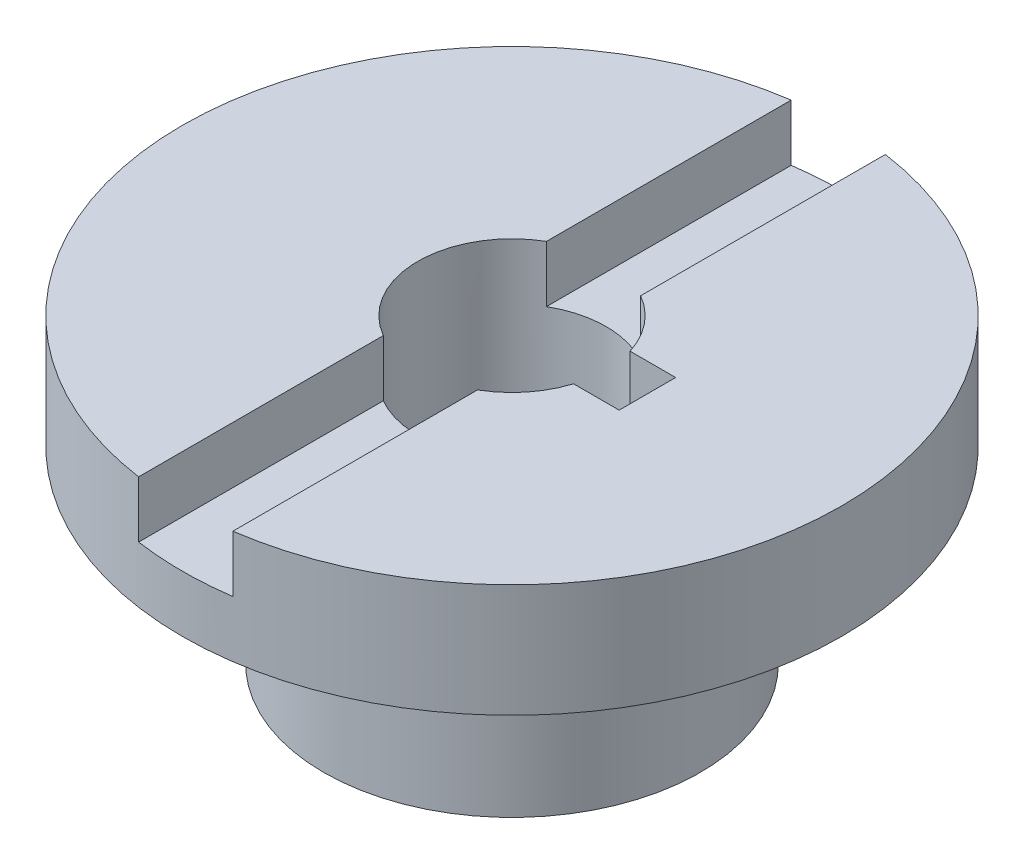
ISO-10303-21;
HEADER;
FILE_DESCRIPTION(('STEP AP214'),'2;1');
FILE_NAME('part.step','',(''),(''),'','','');
FILE_SCHEMA(('AUTOMOTIVE_DESIGN { 1 0 10303 214 1 1 1 1 }'));
ENDSEC;
DATA;
#1=APPLICATION_CONTEXT('core data for automotive mechanical design processes');
#2=APPLICATION_PROTOCOL_DEFINITION('international standard','automotive_design',2000,#1);
#3=PRODUCT_CONTEXT('',#1,'mechanical');
#4=PRODUCT('Part','Part','',(#3));
#5=PRODUCT_RELATED_PRODUCT_CATEGORY('part','',(#4));
#6=PRODUCT_DEFINITION_FORMATION('','',#4);
#7=PRODUCT_DEFINITION_CONTEXT('part definition',#1,'design');
#8=PRODUCT_DEFINITION('design','',#6,#7);
#9=PRODUCT_DEFINITION_SHAPE('','',#8);
#10=(LENGTH_UNIT() NAMED_UNIT(*) SI_UNIT(.MILLI.,.METRE.));
#11=(NAMED_UNIT(*) PLANE_ANGLE_UNIT() SI_UNIT($,.RADIAN.));
#12=(NAMED_UNIT(*) SI_UNIT($,.STERADIAN.) SOLID_ANGLE_UNIT());
#13=UNCERTAINTY_MEASURE_WITH_UNIT(LENGTH_MEASURE(1.E-05),#10,'distance_accuracy_value','');
#14=(GEOMETRIC_REPRESENTATION_CONTEXT(3) GLOBAL_UNCERTAINTY_ASSIGNED_CONTEXT((#13)) GLOBAL_UNIT_ASSIGNED_CONTEXT((#10,
#11,#12)) REPRESENTATION_CONTEXT('',''));
#15=CARTESIAN_POINT('',(0.,0.,0.));
#16=DIRECTION('',(0.,0.,1.));
#17=DIRECTION('',(1.,0.,0.));
#18=AXIS2_PLACEMENT_3D('',#15,#16,#17);
#19=CARTESIAN_POINT('',(-2.49999999999999,13.,27.));
#20=DIRECTION('',(0.,1.,0.));
#21=DIRECTION('',(0.,0.,1.));
#22=AXIS2_PLACEMENT_3D('',#19,#20,#21);
#23=PLANE('',#22);
#24=CARTESIAN_POINT('',(0.,13.,0.));
#25=DIRECTION('',(0.,1.,0.));
#26=DIRECTION('',(0.,0.,1.));
#27=AXIS2_PLACEMENT_3D('',#24,#25,#26);
#28=CIRCLE('',#27,5.);
#29=CARTESIAN_POINT('',(2.50000000000001,13.,-4.33012701892219));
#30=VERTEX_POINT('',#29);
#31=CARTESIAN_POINT('',(-2.49999999999999,13.,-4.3301270189222));
#32=VERTEX_POINT('',#31);
#33=EDGE_CURVE('E174',#30,#32,#28,.T.);
#34=ORIENTED_EDGE('',*,*,#33,.F.);
#35=DIRECTION('',(0.,0.,-1.));
#36=VECTOR('',#35,1.);
#37=CARTESIAN_POINT('',(2.50000000000001,13.,27.));
#38=LINE('',#37,#36);
#39=CARTESIAN_POINT('',(2.50000000000001,13.,-17.3205080756888));
#40=VERTEX_POINT('',#39);
#41=EDGE_CURVE('E188',#30,#40,#38,.T.);
#42=ORIENTED_EDGE('',*,*,#41,.T.);
#43=CARTESIAN_POINT('',(0.,13.,0.));
#44=DIRECTION('',(0.,1.,0.));
#45=DIRECTION('',(0.,0.,1.));
#46=AXIS2_PLACEMENT_3D('',#43,#44,#45);
#47=CIRCLE('',#46,17.5);
#48=CARTESIAN_POINT('',(-2.49999999999999,13.,-17.3205080756888));
#49=VERTEX_POINT('',#48);
#50=EDGE_CURVE('E245',#40,#49,#47,.T.);
#51=ORIENTED_EDGE('',*,*,#50,.T.);
#52=DIRECTION('',(0.,0.,-1.));
#53=VECTOR('',#52,1.);
#54=CARTESIAN_POINT('',(-2.49999999999999,13.,27.));
#55=LINE('',#54,#53);
#56=EDGE_CURVE('E193',#32,#49,#55,.T.);
#57=ORIENTED_EDGE('',*,*,#56,.F.);
#58=EDGE_LOOP('',(#34,#42,#51,#57));
#59=FACE_BOUND('',#58,.T.);
#60=ADVANCED_FACE('F45',(#59),#23,.T.);
#61=CARTESIAN_POINT('',(-2.49999999999999,16.,27.));
#62=DIRECTION('',(1.,0.,0.));
#63=DIRECTION('',(0.,1.,0.));
#64=AXIS2_PLACEMENT_3D('',#61,#62,#63);
#65=PLANE('',#64);
#66=DIRECTION('',(0.,-1.,0.));
#67=VECTOR('',#66,1.);
#68=CARTESIAN_POINT('',(-2.5,30.,4.33012701892219));
#69=LINE('',#68,#67);
#70=CARTESIAN_POINT('',(-2.5,16.,4.33012701892219));
#71=VERTEX_POINT('',#70);
#72=CARTESIAN_POINT('',(-2.49999999999999,13.,4.3301270189222));
#73=VERTEX_POINT('',#72);
#74=EDGE_CURVE('E179',#71,#73,#69,.T.);
#75=ORIENTED_EDGE('',*,*,#74,.F.);
#76=DIRECTION('',(0.,0.,-1.));
#77=VECTOR('',#76,1.);
#78=CARTESIAN_POINT('',(-2.49999999999999,16.,0.));
#79=LINE('',#78,#77);
#80=CARTESIAN_POINT('',(-2.49999999999999,16.,17.3205080756888));
#81=VERTEX_POINT('',#80);
#82=EDGE_CURVE('E238',#81,#71,#79,.T.);
#83=ORIENTED_EDGE('',*,*,#82,.F.);
#84=DIRECTION('',(0.,-1.,0.));
#85=VECTOR('',#84,1.);
#86=CARTESIAN_POINT('',(-2.49999999999999,16.,17.3205080756888));
#87=LINE('',#86,#85);
#88=CARTESIAN_POINT('',(-2.49999999999999,13.,17.3205080756888));
#89=VERTEX_POINT('',#88);
#90=EDGE_CURVE('E210',#81,#89,#87,.T.);
#91=ORIENTED_EDGE('',*,*,#90,.T.);
#92=EDGE_CURVE('E194',#89,#73,#55,.T.);
#93=ORIENTED_EDGE('',*,*,#92,.T.);
#94=EDGE_LOOP('',(#75,#83,#91,#93));
#95=FACE_BOUND('',#94,.T.);
#96=ADVANCED_FACE('F302',(#95),#65,.T.);
#97=CARTESIAN_POINT('',(2.50000000000001,16.,27.));
#98=DIRECTION('',(-1.,0.,0.));
#99=DIRECTION('',(0.,0.,1.));
#100=AXIS2_PLACEMENT_3D('',#97,#98,#99);
#101=PLANE('',#100);
#102=DIRECTION('',(0.,-1.,0.));
#103=VECTOR('',#102,1.);
#104=CARTESIAN_POINT('',(2.50000000000001,30.,-4.33012701892219));
#105=LINE('',#104,#103);
#106=CARTESIAN_POINT('',(2.50000000000001,16.,-4.33012701892219));
#107=VERTEX_POINT('',#106);
#108=EDGE_CURVE('E249',#107,#30,#105,.T.);
#109=ORIENTED_EDGE('',*,*,#108,.F.);
#110=DIRECTION('',(0.,0.,1.));
#111=VECTOR('',#110,1.);
#112=CARTESIAN_POINT('',(2.50000000000001,16.,0.));
#113=LINE('',#112,#111);
#114=CARTESIAN_POINT('',(2.50000000000001,16.,-17.3205080756888));
#115=VERTEX_POINT('',#114);
#116=EDGE_CURVE('E233',#115,#107,#113,.T.);
#117=ORIENTED_EDGE('',*,*,#116,.F.);
#118=DIRECTION('',(0.,-1.,0.));
#119=VECTOR('',#118,1.);
#120=CARTESIAN_POINT('',(2.50000000000001,16.,-17.3205080756888));
#121=LINE('',#120,#119);
#122=EDGE_CURVE('E202',#115,#40,#121,.T.);
#123=ORIENTED_EDGE('',*,*,#122,.T.);
#124=ORIENTED_EDGE('',*,*,#41,.F.);
#125=EDGE_LOOP('',(#109,#117,#123,#124));
#126=FACE_BOUND('',#125,.T.);
#127=ADVANCED_FACE('F288',(#126),#101,.T.);
#128=CARTESIAN_POINT('',(0.,16.,0.));
#129=DIRECTION('',(0.,-1.,0.));
#130=DIRECTION('',(0.,0.,-1.));
#131=AXIS2_PLACEMENT_3D('',#128,#129,#130);
#132=CYLINDRICAL_SURFACE('',#131,17.5);
#133=CARTESIAN_POINT('',(0.,10.,0.));
#134=DIRECTION('',(0.,1.,0.));
#135=DIRECTION('',(0.,0.,1.));
#136=AXIS2_PLACEMENT_3D('',#133,#134,#135);
#137=CIRCLE('',#136,17.5);
#138=CARTESIAN_POINT('',(0.,10.,17.5));
#139=VERTEX_POINT('',#138);
#140=EDGE_CURVE('E213',#139,#139,#137,.T.);
#141=ORIENTED_EDGE('',*,*,#140,.T.);
#142=EDGE_LOOP('',(#141));
#143=FACE_BOUND('',#142,.T.);
#144=DIRECTION('',(0.,-1.,0.));
#145=VECTOR('',#144,1.);
#146=CARTESIAN_POINT('',(-2.49999999999999,16.,-17.3205080756888));
#147=LINE('',#146,#145);
#148=CARTESIAN_POINT('',(-2.49999999999999,16.,-17.3205080756888));
#149=VERTEX_POINT('',#148);
#150=EDGE_CURVE('E206',#49,#149,#147,.F.);
#151=ORIENTED_EDGE('',*,*,#150,.F.);
#152=ORIENTED_EDGE('',*,*,#50,.F.);
#153=ORIENTED_EDGE('',*,*,#122,.F.);
#154=CARTESIAN_POINT('',(0.,16.,0.));
#155=DIRECTION('',(0.,1.,0.));
#156=DIRECTION('',(0.,0.,1.));
#157=AXIS2_PLACEMENT_3D('',#154,#155,#156);
#158=CIRCLE('',#157,17.5);
#159=CARTESIAN_POINT('',(2.50000000000001,16.,17.3205080756888));
#160=VERTEX_POINT('',#159);
#161=EDGE_CURVE('E214',#160,#115,#158,.T.);
#162=ORIENTED_EDGE('',*,*,#161,.F.);
#163=DIRECTION('',(0.,-1.,0.));
#164=VECTOR('',#163,1.);
#165=CARTESIAN_POINT('',(2.50000000000001,16.,17.3205080756888));
#166=LINE('',#165,#164);
#167=CARTESIAN_POINT('',(2.50000000000001,13.,17.3205080756888));
#168=VERTEX_POINT('',#167);
#169=EDGE_CURVE('E198',#168,#160,#166,.F.);
#170=ORIENTED_EDGE('',*,*,#169,.F.);
#171=EDGE_CURVE('E242',#89,#168,#47,.T.);
#172=ORIENTED_EDGE('',*,*,#171,.F.);
#173=ORIENTED_EDGE('',*,*,#90,.F.);
#174=EDGE_CURVE('E218',#149,#81,#158,.T.);
#175=ORIENTED_EDGE('',*,*,#174,.F.);
#176=EDGE_LOOP('',(#151,#152,#153,#162,#170,#172,#173,#175));
#177=FACE_BOUND('',#176,.T.);
#178=ADVANCED_FACE('F270',(#143,#177),#132,.T.);
#179=CARTESIAN_POINT('',(0.,16.,0.));
#180=DIRECTION('',(0.,1.,0.));
#181=DIRECTION('',(0.,0.,1.));
#182=AXIS2_PLACEMENT_3D('',#179,#180,#181);
#183=PLANE('',#182);
#184=CARTESIAN_POINT('',(0.,16.,0.));
#185=DIRECTION('',(0.,1.,0.));
#186=DIRECTION('',(0.,0.,1.));
#187=AXIS2_PLACEMENT_3D('',#184,#185,#186);
#188=CIRCLE('',#187,5.);
#189=CARTESIAN_POINT('',(-2.49999999999999,16.,-4.3301270189222));
#190=VERTEX_POINT('',#189);
#191=EDGE_CURVE('E182',#190,#71,#188,.T.);
#192=ORIENTED_EDGE('',*,*,#191,.F.);
#193=EDGE_CURVE('E237',#190,#149,#79,.T.);
#194=ORIENTED_EDGE('',*,*,#193,.T.);
#195=ORIENTED_EDGE('',*,*,#174,.T.);
#196=ORIENTED_EDGE('',*,*,#82,.T.);
#197=EDGE_LOOP('',(#192,#194,#195,#196));
#198=FACE_BOUND('',#197,.T.);
#199=ADVANCED_FACE('F299',(#198),#183,.T.);
#200=DIRECTION('',(-1.,0.,0.));
#201=VECTOR('',#200,1.);
#202=CARTESIAN_POINT('',(0.,16.,-1.5));
#203=LINE('',#202,#201);
#204=CARTESIAN_POINT('',(7.18836867784672,16.,-1.5));
#205=VERTEX_POINT('',#204);
#206=CARTESIAN_POINT('',(4.76969600708473,16.,-1.5));
#207=VERTEX_POINT('',#206);
#208=EDGE_CURVE('E165',#205,#207,#203,.T.);
#209=ORIENTED_EDGE('',*,*,#208,.F.);
#210=DIRECTION('',(0.,0.,-1.));
#211=VECTOR('',#210,1.);
#212=CARTESIAN_POINT('',(7.18836867784672,16.,0.));
#213=LINE('',#212,#211);
#214=CARTESIAN_POINT('',(7.18836867784672,16.,1.5));
#215=VERTEX_POINT('',#214);
#216=EDGE_CURVE('E168',#215,#205,#213,.T.);
#217=ORIENTED_EDGE('',*,*,#216,.F.);
#218=DIRECTION('',(1.,0.,0.));
#219=VECTOR('',#218,1.);
#220=CARTESIAN_POINT('',(0.,16.,1.5));
#221=LINE('',#220,#219);
#222=CARTESIAN_POINT('',(4.76969600708473,16.,1.5));
#223=VERTEX_POINT('',#222);
#224=EDGE_CURVE('E136',#223,#215,#221,.T.);
#225=ORIENTED_EDGE('',*,*,#224,.F.);
#226=CARTESIAN_POINT('',(0.,16.,0.));
#227=DIRECTION('',(0.,1.,0.));
#228=DIRECTION('',(0.,0.,1.));
#229=AXIS2_PLACEMENT_3D('',#226,#227,#228);
#230=CIRCLE('',#229,5.);
#231=CARTESIAN_POINT('',(2.50000000000001,16.,4.33012701892219));
#232=VERTEX_POINT('',#231);
#233=EDGE_CURVE('E175',#232,#223,#230,.T.);
#234=ORIENTED_EDGE('',*,*,#233,.F.);
#235=EDGE_CURVE('E229',#232,#160,#113,.T.);
#236=ORIENTED_EDGE('',*,*,#235,.T.);
#237=ORIENTED_EDGE('',*,*,#161,.T.);
#238=ORIENTED_EDGE('',*,*,#116,.T.);
#239=EDGE_CURVE('E173',#207,#107,#230,.T.);
#240=ORIENTED_EDGE('',*,*,#239,.F.);
#241=EDGE_LOOP('',(#209,#217,#225,#234,#236,#237,#238,#240));
#242=FACE_BOUND('',#241,.T.);
#243=ADVANCED_FACE('F255',(#242),#183,.T.);
#244=CARTESIAN_POINT('',(0.,0.,0.));
#245=DIRECTION('',(0.,1.,0.));
#246=DIRECTION('',(0.,0.,1.));
#247=AXIS2_PLACEMENT_3D('',#244,#245,#246);
#248=PLANE('',#247);
#249=CARTESIAN_POINT('',(0.,0.,0.));
#250=DIRECTION('',(0.,1.,0.));
#251=DIRECTION('',(0.,0.,1.));
#252=AXIS2_PLACEMENT_3D('',#249,#250,#251);
#253=CIRCLE('',#252,10.);
#254=CARTESIAN_POINT('',(0.,0.,10.));
#255=VERTEX_POINT('',#254);
#256=EDGE_CURVE('E224',#255,#255,#253,.T.);
#257=ORIENTED_EDGE('',*,*,#256,.F.);
#258=EDGE_LOOP('',(#257));
#259=FACE_BOUND('',#258,.T.);
#260=DIRECTION('',(0.,0.,1.));
#261=VECTOR('',#260,1.);
#262=CARTESIAN_POINT('',(7.18836867784672,0.,1.5));
#263=LINE('',#262,#261);
#264=CARTESIAN_POINT('',(7.18836867784672,0.,-1.5));
#265=VERTEX_POINT('',#264);
#266=CARTESIAN_POINT('',(7.18836867784672,0.,1.5));
#267=VERTEX_POINT('',#266);
#268=EDGE_CURVE('E144',#265,#267,#263,.T.);
#269=ORIENTED_EDGE('',*,*,#268,.F.);
#270=DIRECTION('',(1.,0.,0.));
#271=VECTOR('',#270,1.);
#272=CARTESIAN_POINT('',(4.66567016541048,0.,-1.5));
#273=LINE('',#272,#271);
#274=CARTESIAN_POINT('',(4.76969600708473,0.,-1.5));
#275=VERTEX_POINT('',#274);
#276=EDGE_CURVE('E141',#275,#265,#273,.T.);
#277=ORIENTED_EDGE('',*,*,#276,.F.);
#278=CARTESIAN_POINT('',(0.,0.,0.));
#279=DIRECTION('',(0.,1.,0.));
#280=DIRECTION('',(0.,0.,1.));
#281=AXIS2_PLACEMENT_3D('',#278,#279,#280);
#282=CIRCLE('',#281,5.);
#283=CARTESIAN_POINT('',(4.76969600708473,0.,1.5));
#284=VERTEX_POINT('',#283);
#285=EDGE_CURVE('E155',#275,#284,#282,.T.);
#286=ORIENTED_EDGE('',*,*,#285,.T.);
#287=DIRECTION('',(-1.,0.,0.));
#288=VECTOR('',#287,1.);
#289=CARTESIAN_POINT('',(4.66567016541048,0.,1.5));
#290=LINE('',#289,#288);
#291=EDGE_CURVE('E61',#267,#284,#290,.T.);
#292=ORIENTED_EDGE('',*,*,#291,.F.);
#293=EDGE_LOOP('',(#269,#277,#286,#292));
#294=FACE_BOUND('',#293,.T.);
#295=ADVANCED_FACE('F153',(#259,#294),#248,.F.);
#296=CARTESIAN_POINT('',(0.,10.,0.));
#297=DIRECTION('',(0.,-1.,0.));
#298=DIRECTION('',(0.,0.,-1.));
#299=AXIS2_PLACEMENT_3D('',#296,#297,#298);
#300=CYLINDRICAL_SURFACE('',#299,10.);
#301=CARTESIAN_POINT('',(0.,10.,0.));
#302=DIRECTION('',(0.,1.,0.));
#303=DIRECTION('',(0.,0.,1.));
#304=AXIS2_PLACEMENT_3D('',#301,#302,#303);
#305=CIRCLE('',#304,10.);
#306=CARTESIAN_POINT('',(0.,10.,10.));
#307=VERTEX_POINT('',#306);
#308=EDGE_CURVE('E225',#307,#307,#305,.T.);
#309=ORIENTED_EDGE('',*,*,#308,.F.);
#310=EDGE_LOOP('',(#309));
#311=FACE_BOUND('',#310,.T.);
#312=ORIENTED_EDGE('',*,*,#256,.T.);
#313=EDGE_LOOP('',(#312));
#314=FACE_BOUND('',#313,.T.);
#315=ADVANCED_FACE('F47',(#311,#314),#300,.T.);
#316=CARTESIAN_POINT('',(0.,10.,0.));
#317=DIRECTION('',(0.,-1.,0.));
#318=DIRECTION('',(0.,0.,-1.));
#319=AXIS2_PLACEMENT_3D('',#316,#317,#318);
#320=CYLINDRICAL_SURFACE('',#319,5.);
#321=DIRECTION('',(0.,-1.,0.));
#322=VECTOR('',#321,1.);
#323=CARTESIAN_POINT('',(4.76969600708473,10.,-1.5));
#324=LINE('',#323,#322);
#325=EDGE_CURVE('E12',#207,#275,#324,.T.);
#326=ORIENTED_EDGE('',*,*,#325,.F.);
#327=ORIENTED_EDGE('',*,*,#239,.T.);
#328=ORIENTED_EDGE('',*,*,#108,.T.);
#329=ORIENTED_EDGE('',*,*,#33,.T.);
#330=DIRECTION('',(0.,-1.,0.));
#331=VECTOR('',#330,1.);
#332=CARTESIAN_POINT('',(-2.5,30.,-4.33012701892219));
#333=LINE('',#332,#331);
#334=EDGE_CURVE('E185',#32,#190,#333,.F.);
#335=ORIENTED_EDGE('',*,*,#334,.T.);
#336=ORIENTED_EDGE('',*,*,#191,.T.);
#337=ORIENTED_EDGE('',*,*,#74,.T.);
#338=CARTESIAN_POINT('',(2.50000000000001,13.,4.33012701892219));
#339=VERTEX_POINT('',#338);
#340=EDGE_CURVE('E69',#73,#339,#28,.T.);
#341=ORIENTED_EDGE('',*,*,#340,.T.);
#342=DIRECTION('',(0.,-1.,0.));
#343=VECTOR('',#342,1.);
#344=CARTESIAN_POINT('',(2.50000000000001,30.,4.33012701892219));
#345=LINE('',#344,#343);
#346=EDGE_CURVE('E246',#339,#232,#345,.F.);
#347=ORIENTED_EDGE('',*,*,#346,.T.);
#348=ORIENTED_EDGE('',*,*,#233,.T.);
#349=DIRECTION('',(0.,-1.,0.));
#350=VECTOR('',#349,1.);
#351=CARTESIAN_POINT('',(4.76969600708473,10.,1.5));
#352=LINE('',#351,#350);
#353=EDGE_CURVE('E54',#284,#223,#352,.F.);
#354=ORIENTED_EDGE('',*,*,#353,.F.);
#355=ORIENTED_EDGE('',*,*,#285,.F.);
#356=EDGE_LOOP('',(#326,#327,#328,#329,#335,#336,#337,#341,#347,#348,#354,#355));
#357=FACE_BOUND('',#356,.T.);
#358=ADVANCED_FACE('F258',(#357),#320,.F.);
#359=CARTESIAN_POINT('',(0.,10.,0.));
#360=DIRECTION('',(0.,1.,0.));
#361=DIRECTION('',(0.,0.,1.));
#362=AXIS2_PLACEMENT_3D('',#359,#360,#361);
#363=PLANE('',#362);
#364=ORIENTED_EDGE('',*,*,#308,.T.);
#365=EDGE_LOOP('',(#364));
#366=FACE_BOUND('',#365,.T.);
#367=ORIENTED_EDGE('',*,*,#140,.F.);
#368=EDGE_LOOP('',(#367));
#369=FACE_BOUND('',#368,.T.);
#370=ADVANCED_FACE('F317',(#366,#369),#363,.F.);
#371=ORIENTED_EDGE('',*,*,#340,.F.);
#372=ORIENTED_EDGE('',*,*,#92,.F.);
#373=ORIENTED_EDGE('',*,*,#171,.T.);
#374=EDGE_CURVE('E189',#168,#339,#38,.T.);
#375=ORIENTED_EDGE('',*,*,#374,.T.);
#376=EDGE_LOOP('',(#371,#372,#373,#375));
#377=FACE_BOUND('',#376,.T.);
#378=ADVANCED_FACE('F264',(#377),#23,.T.);
#379=ORIENTED_EDGE('',*,*,#334,.F.);
#380=ORIENTED_EDGE('',*,*,#56,.T.);
#381=ORIENTED_EDGE('',*,*,#150,.T.);
#382=ORIENTED_EDGE('',*,*,#193,.F.);
#383=EDGE_LOOP('',(#379,#380,#381,#382));
#384=FACE_BOUND('',#383,.T.);
#385=ADVANCED_FACE('F296',(#384),#65,.T.);
#386=ORIENTED_EDGE('',*,*,#346,.F.);
#387=ORIENTED_EDGE('',*,*,#374,.F.);
#388=ORIENTED_EDGE('',*,*,#169,.T.);
#389=ORIENTED_EDGE('',*,*,#235,.F.);
#390=EDGE_LOOP('',(#386,#387,#388,#389));
#391=FACE_BOUND('',#390,.T.);
#392=ADVANCED_FACE('F261',(#391),#101,.T.);
#393=CARTESIAN_POINT('',(7.18836867784672,20.,1.5));
#394=DIRECTION('',(1.,0.,0.));
#395=DIRECTION('',(0.,0.,-1.));
#396=AXIS2_PLACEMENT_3D('',#393,#394,#395);
#397=PLANE('',#396);
#398=ORIENTED_EDGE('',*,*,#216,.T.);
#399=DIRECTION('',(0.,-1.,0.));
#400=VECTOR('',#399,1.);
#401=CARTESIAN_POINT('',(7.18836867784672,20.,-1.5));
#402=LINE('',#401,#400);
#403=EDGE_CURVE('E140',#205,#265,#402,.T.);
#404=ORIENTED_EDGE('',*,*,#403,.T.);
#405=ORIENTED_EDGE('',*,*,#268,.T.);
#406=DIRECTION('',(0.,-1.,0.));
#407=VECTOR('',#406,1.);
#408=CARTESIAN_POINT('',(7.18836867784672,20.,1.5));
#409=LINE('',#408,#407);
#410=EDGE_CURVE('E132',#215,#267,#409,.T.);
#411=ORIENTED_EDGE('',*,*,#410,.F.);
#412=EDGE_LOOP('',(#398,#404,#405,#411));
#413=FACE_BOUND('',#412,.T.);
#414=ADVANCED_FACE('F145',(#413),#397,.F.);
#415=CARTESIAN_POINT('',(4.66567016541048,20.,-1.5));
#416=DIRECTION('',(0.,0.,-1.));
#417=DIRECTION('',(-1.,0.,0.));
#418=AXIS2_PLACEMENT_3D('',#415,#416,#417);
#419=PLANE('',#418);
#420=ORIENTED_EDGE('',*,*,#208,.T.);
#421=ORIENTED_EDGE('',*,*,#325,.T.);
#422=ORIENTED_EDGE('',*,*,#276,.T.);
#423=ORIENTED_EDGE('',*,*,#403,.F.);
#424=EDGE_LOOP('',(#420,#421,#422,#423));
#425=FACE_BOUND('',#424,.T.);
#426=ADVANCED_FACE('F326',(#425),#419,.F.);
#427=CARTESIAN_POINT('',(4.66567016541048,20.,1.5));
#428=DIRECTION('',(0.,0.,1.));
#429=DIRECTION('',(1.,0.,0.));
#430=AXIS2_PLACEMENT_3D('',#427,#428,#429);
#431=PLANE('',#430);
#432=ORIENTED_EDGE('',*,*,#224,.T.);
#433=ORIENTED_EDGE('',*,*,#410,.T.);
#434=ORIENTED_EDGE('',*,*,#291,.T.);
#435=ORIENTED_EDGE('',*,*,#353,.T.);
#436=EDGE_LOOP('',(#432,#433,#434,#435));
#437=FACE_BOUND('',#436,.T.);
#438=ADVANCED_FACE('F134',(#437),#431,.F.);
#439=CLOSED_SHELL('',(#60,#96,#127,#178,#199,#243,#295,#315,#358,#370,#378,#385,#392,#414,#426,#438));
#440=MANIFOLD_SOLID_BREP('B2',#439);
#441=ADVANCED_BREP_SHAPE_REPRESENTATION('',(#18,#440),#14);
#442=SHAPE_DEFINITION_REPRESENTATION(#9,#441);
ENDSEC;
END-ISO-10303-21;
